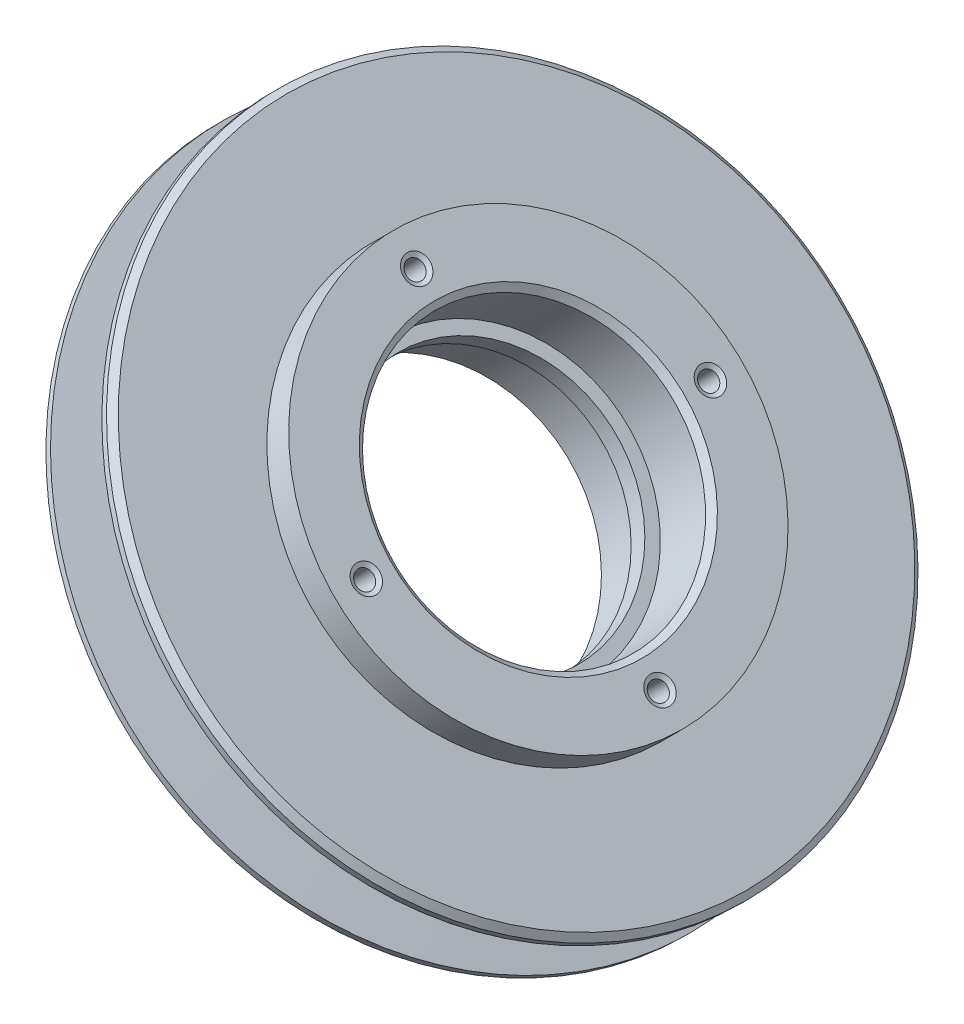
ISO-10303-21;
HEADER;
FILE_DESCRIPTION(('STEP AP214'),'2;1');
FILE_NAME('part.step','',(''),(''),'','','');
FILE_SCHEMA(('AUTOMOTIVE_DESIGN { 1 0 10303 214 1 1 1 1 }'));
ENDSEC;
DATA;
#1=APPLICATION_CONTEXT('core data for automotive mechanical design processes');
#2=APPLICATION_PROTOCOL_DEFINITION('international standard','automotive_design',2000,#1);
#3=PRODUCT_CONTEXT('',#1,'mechanical');
#4=PRODUCT('Part','Part','',(#3));
#5=PRODUCT_RELATED_PRODUCT_CATEGORY('part','',(#4));
#6=PRODUCT_DEFINITION_FORMATION('','',#4);
#7=PRODUCT_DEFINITION_CONTEXT('part definition',#1,'design');
#8=PRODUCT_DEFINITION('design','',#6,#7);
#9=PRODUCT_DEFINITION_SHAPE('','',#8);
#10=(LENGTH_UNIT() NAMED_UNIT(*) SI_UNIT(.MILLI.,.METRE.));
#11=(NAMED_UNIT(*) PLANE_ANGLE_UNIT() SI_UNIT($,.RADIAN.));
#12=(NAMED_UNIT(*) SI_UNIT($,.STERADIAN.) SOLID_ANGLE_UNIT());
#13=UNCERTAINTY_MEASURE_WITH_UNIT(LENGTH_MEASURE(1.E-05),#10,'distance_accuracy_value','');
#14=(GEOMETRIC_REPRESENTATION_CONTEXT(3) GLOBAL_UNCERTAINTY_ASSIGNED_CONTEXT((#13)) GLOBAL_UNIT_ASSIGNED_CONTEXT((#10,
#11,#12)) REPRESENTATION_CONTEXT('',''));
#15=CARTESIAN_POINT('',(0.,0.,0.));
#16=DIRECTION('',(0.,0.,1.));
#17=DIRECTION('',(1.,0.,0.));
#18=AXIS2_PLACEMENT_3D('',#15,#16,#17);
#19=CARTESIAN_POINT('',(-613.203104932864,800.665960875843,6.97564737441197));
#20=DIRECTION('',(0.707106785895525,0.70710677647757,0.));
#21=DIRECTION('',(-0.70710677647757,0.707106785895525,0.));
#22=AXIS2_PLACEMENT_3D('',#19,#20,#21);
#23=CYLINDRICAL_SURFACE('',#22,15.8750000000003);
#24=CARTESIAN_POINT('',(-613.764370944168,800.104694872014,6.97564737441197));
#25=DIRECTION('',(0.707106785895525,0.70710677647757,0.));
#26=DIRECTION('',(0.,0.,1.));
#27=AXIS2_PLACEMENT_3D('',#24,#25,#26);
#28=CIRCLE('',#27,15.8750000000003);
#29=CARTESIAN_POINT('',(-613.764370944168,800.104694872014,22.8506473744123));
#30=VERTEX_POINT('',#29);
#31=EDGE_CURVE('E10',#30,#30,#28,.T.);
#32=ORIENTED_EDGE('',*,*,#31,.T.);
#33=EDGE_LOOP('',(#32));
#34=FACE_BOUND('',#33,.T.);
#35=CARTESIAN_POINT('',(-615.470260408288,798.398805430616,6.97564737441196));
#36=DIRECTION('',(0.707106785895525,0.70710677647757,0.));
#37=DIRECTION('',(0.,0.,1.));
#38=AXIS2_PLACEMENT_3D('',#35,#36,#37);
#39=CIRCLE('',#38,15.8750000000003);
#40=CARTESIAN_POINT('',(-615.470260408288,798.398805430616,22.8506473744123));
#41=VERTEX_POINT('',#40);
#42=EDGE_CURVE('E31',#41,#41,#39,.T.);
#43=ORIENTED_EDGE('',*,*,#42,.F.);
#44=EDGE_LOOP('',(#43));
#45=FACE_BOUND('',#44,.T.);
#46=ADVANCED_FACE('F15',(#34,#45),#23,.F.);
#47=CARTESIAN_POINT('',(-613.764370944169,800.104694872014,23.6443973744122));
#48=DIRECTION('',(0.707106785895525,0.70710677647757,0.));
#49=DIRECTION('',(-0.70710677647757,0.707106785895525,0.));
#50=AXIS2_PLACEMENT_3D('',#47,#48,#49);
#51=PLANE('',#50);
#52=ORIENTED_EDGE('',*,*,#31,.F.);
#53=EDGE_LOOP('',(#52));
#54=FACE_BOUND('',#53,.T.);
#55=CARTESIAN_POINT('',(-613.764370944168,800.104694872014,6.97564737441197));
#56=DIRECTION('',(0.707106785895525,0.70710677647757,0.));
#57=DIRECTION('',(-0.70710677647757,0.707106785895525,0.));
#58=AXIS2_PLACEMENT_3D('',#55,#56,#57);
#59=CIRCLE('',#58,17.45234);
#60=CARTESIAN_POINT('',(-626.105038823559,812.44536291577,6.97564737441196));
#61=VERTEX_POINT('',#60);
#62=EDGE_CURVE('E23',#61,#61,#59,.T.);
#63=ORIENTED_EDGE('',*,*,#62,.T.);
#64=EDGE_LOOP('',(#63));
#65=FACE_BOUND('',#64,.T.);
#66=ADVANCED_FACE('F155',(#54,#65),#51,.T.);
#67=CARTESIAN_POINT('',(-609.554875859384,804.314189900732,6.97564737441197));
#68=DIRECTION('',(0.707106785895525,0.70710677647757,0.));
#69=DIRECTION('',(-0.70710677647757,0.707106785895525,0.));
#70=AXIS2_PLACEMENT_3D('',#67,#68,#69);
#71=CYLINDRICAL_SURFACE('',#70,17.45234);
#72=CARTESIAN_POINT('',(-608.129260190671,805.739805550458,6.97564737441197));
#73=DIRECTION('',(0.707106785895525,0.70710677647757,0.));
#74=DIRECTION('',(-0.70710677647757,0.707106785895525,0.));
#75=AXIS2_PLACEMENT_3D('',#72,#73,#74);
#76=CIRCLE('',#75,17.45234);
#77=CARTESIAN_POINT('',(-620.469928070062,818.080473594214,6.97564737441196));
#78=VERTEX_POINT('',#77);
#79=EDGE_CURVE('E28',#78,#78,#76,.T.);
#80=ORIENTED_EDGE('',*,*,#79,.T.);
#81=EDGE_LOOP('',(#80));
#82=FACE_BOUND('',#81,.T.);
#83=ORIENTED_EDGE('',*,*,#62,.F.);
#84=EDGE_LOOP('',(#83));
#85=FACE_BOUND('',#84,.T.);
#86=ADVANCED_FACE('F160',(#82,#85),#71,.F.);
#87=CARTESIAN_POINT('',(-613.203104932864,800.665960875843,6.97564737441197));
#88=DIRECTION('',(-0.707106785895525,-0.70710677647757,0.));
#89=DIRECTION('',(0.70710677647757,-0.707106785895525,0.));
#90=AXIS2_PLACEMENT_3D('',#87,#88,#89);
#91=CYLINDRICAL_SURFACE('',#90,25.4);
#92=CARTESIAN_POINT('',(-610.306795537838,803.562270232293,6.97564737441197));
#93=DIRECTION('',(-0.707106785895525,-0.70710677647757,0.));
#94=DIRECTION('',(0.70710677647757,-0.707106785895525,0.));
#95=AXIS2_PLACEMENT_3D('',#92,#93,#94);
#96=CIRCLE('',#95,25.4);
#97=CARTESIAN_POINT('',(-592.346283415308,785.601757870547,6.97564737441199));
#98=VERTEX_POINT('',#97);
#99=EDGE_CURVE('E42',#98,#98,#96,.T.);
#100=ORIENTED_EDGE('',*,*,#99,.F.);
#101=EDGE_LOOP('',(#100));
#102=FACE_BOUND('',#101,.T.);
#103=CARTESIAN_POINT('',(-607.590444819818,806.278620914134,6.97564737441197));
#104=DIRECTION('',(-0.707106785895525,-0.70710677647757,0.));
#105=DIRECTION('',(0.70710677647757,-0.707106785895525,0.));
#106=AXIS2_PLACEMENT_3D('',#103,#104,#105);
#107=CIRCLE('',#106,25.4);
#108=CARTESIAN_POINT('',(-589.629932697288,788.318108552388,6.97564737441199));
#109=VERTEX_POINT('',#108);
#110=EDGE_CURVE('E38',#109,#109,#107,.T.);
#111=ORIENTED_EDGE('',*,*,#110,.T.);
#112=EDGE_LOOP('',(#111));
#113=FACE_BOUND('',#112,.T.);
#114=ADVANCED_FACE('F167',(#102,#113),#91,.T.);
#115=CARTESIAN_POINT('',(-608.039457628862,805.829608111071,6.97564737441198));
#116=DIRECTION('',(-0.707106785895525,-0.70710677647757,0.));
#117=DIRECTION('',(0.70710677647757,-0.707106785895525,0.));
#118=AXIS2_PLACEMENT_3D('',#115,#116,#117);
#119=CYLINDRICAL_SURFACE('',#118,41.275);
#120=CARTESIAN_POINT('',(-611.415208501932,802.453857282962,6.97564737441198));
#121=DIRECTION('',(0.707106785895524,0.707106776477571,0.));
#122=DIRECTION('',(-0.703493124172285,0.703493133542108,-0.100969477078094));
#123=AXIS2_PLACEMENT_3D('',#120,#121,#122);
#124=CIRCLE('',#123,41.2749999999999);
#125=CARTESIAN_POINT('',(-640.451887202143,831.490536369912,2.80813220801366));
#126=VERTEX_POINT('',#125);
#127=EDGE_CURVE('E41',#126,#126,#124,.T.);
#128=ORIENTED_EDGE('',*,*,#127,.T.);
#129=EDGE_LOOP('',(#128));
#130=FACE_BOUND('',#129,.T.);
#131=CARTESIAN_POINT('',(-610.845610908691,803.023454868617,6.97564737441198));
#132=DIRECTION('',(-0.707106785895525,-0.70710677647757,0.));
#133=DIRECTION('',(0.70710677647757,-0.707106785895525,0.));
#134=AXIS2_PLACEMENT_3D('',#131,#132,#133);
#135=CIRCLE('',#134,41.275);
#136=CARTESIAN_POINT('',(-581.659778709579,773.837622280779,6.97564737441201));
#137=VERTEX_POINT('',#136);
#138=EDGE_CURVE('E49',#137,#137,#135,.T.);
#139=ORIENTED_EDGE('',*,*,#138,.T.);
#140=EDGE_LOOP('',(#139));
#141=FACE_BOUND('',#140,.T.);
#142=ADVANCED_FACE('F171',(#130,#141),#119,.T.);
#143=CARTESIAN_POINT('',(-621.644186532638,792.224879388496,26.8219630315023));
#144=DIRECTION('',(-0.707106785895525,-0.70710677647757,0.));
#145=DIRECTION('',(0.70710677647757,-0.707106785895525,0.));
#146=AXIS2_PLACEMENT_3D('',#143,#144,#145);
#147=PLANE('',#146);
#148=CARTESIAN_POINT('',(-621.644186532637,792.224879388496,-14.4556026255881));
#149=DIRECTION('',(-0.707106785895524,-0.707106776477571,0.));
#150=DIRECTION('',(0.707106776477571,-0.707106785895524,0.));
#151=AXIS2_PLACEMENT_3D('',#148,#149,#150);
#152=CIRCLE('',#151,1.65100000000001);
#153=CARTESIAN_POINT('',(-620.476753244673,791.057446084983,-14.4556026255881));
#154=VERTEX_POINT('',#153);
#155=EDGE_CURVE('E53',#154,#154,#152,.T.);
#156=ORIENTED_EDGE('',*,*,#155,.F.);
#157=EDGE_LOOP('',(#156));
#158=FACE_BOUND('',#157,.T.);
#159=CARTESIAN_POINT('',(-621.644186532638,792.224879388496,6.97564737441197));
#160=DIRECTION('',(-0.707106785895525,-0.70710677647757,0.));
#161=DIRECTION('',(0.70710677647757,-0.707106785895525,0.));
#162=AXIS2_PLACEMENT_3D('',#159,#160,#161);
#163=CIRCLE('',#162,18.21434);
#164=CARTESIAN_POINT('',(-608.764703289572,779.345395973888,6.97564737441198));
#165=VERTEX_POINT('',#164);
#166=EDGE_CURVE('E58',#165,#165,#163,.T.);
#167=ORIENTED_EDGE('',*,*,#166,.F.);
#168=EDGE_LOOP('',(#167));
#169=FACE_BOUND('',#168,.T.);
#170=CARTESIAN_POINT('',(-636.798368636023,807.379061693719,6.97564737441207));
#171=DIRECTION('',(-0.707106785895524,-0.707106776477571,0.));
#172=DIRECTION('',(0.707106776477571,-0.707106785895524,0.));
#173=AXIS2_PLACEMENT_3D('',#170,#171,#172);
#174=CIRCLE('',#173,1.65100000000001);
#175=CARTESIAN_POINT('',(-635.630935348059,806.211628390205,6.97564737441207));
#176=VERTEX_POINT('',#175);
#177=EDGE_CURVE('E46',#176,#176,#174,.T.);
#178=ORIENTED_EDGE('',*,*,#177,.F.);
#179=EDGE_LOOP('',(#178));
#180=FACE_BOUND('',#179,.T.);
#181=CARTESIAN_POINT('',(-606.490004429253,777.070697083272,6.97564737441206));
#182=DIRECTION('',(-0.707106785895524,-0.707106776477571,0.));
#183=DIRECTION('',(0.707106776477571,-0.707106785895524,0.));
#184=AXIS2_PLACEMENT_3D('',#181,#182,#183);
#185=CIRCLE('',#184,1.651);
#186=CARTESIAN_POINT('',(-605.322571141289,775.903263779759,6.97564737441206));
#187=VERTEX_POINT('',#186);
#188=EDGE_CURVE('E66',#187,#187,#185,.T.);
#189=ORIENTED_EDGE('',*,*,#188,.F.);
#190=EDGE_LOOP('',(#189));
#191=FACE_BOUND('',#190,.T.);
#192=CARTESIAN_POINT('',(-621.644186532637,792.224879388496,28.4068973744121));
#193=DIRECTION('',(-0.707106785895524,-0.707106776477571,0.));
#194=DIRECTION('',(0.707106776477571,-0.707106785895524,0.));
#195=AXIS2_PLACEMENT_3D('',#192,#193,#194);
#196=CIRCLE('',#195,1.65100000000001);
#197=CARTESIAN_POINT('',(-620.476753244673,791.057446084983,28.4068973744121));
#198=VERTEX_POINT('',#197);
#199=EDGE_CURVE('E69',#198,#198,#196,.T.);
#200=ORIENTED_EDGE('',*,*,#199,.F.);
#201=EDGE_LOOP('',(#200));
#202=FACE_BOUND('',#201,.T.);
#203=CARTESIAN_POINT('',(-621.644186532638,792.224879388496,6.97564737441198));
#204=DIRECTION('',(-0.707106785895525,-0.70710677647757,0.));
#205=DIRECTION('',(0.70710677647757,-0.707106785895525,0.));
#206=AXIS2_PLACEMENT_3D('',#203,#204,#205);
#207=CIRCLE('',#206,25.4);
#208=CARTESIAN_POINT('',(-603.683674410108,774.26436702675,6.975647374412));
#209=VERTEX_POINT('',#208);
#210=EDGE_CURVE('E52',#209,#209,#207,.T.);
#211=ORIENTED_EDGE('',*,*,#210,.T.);
#212=EDGE_LOOP('',(#211));
#213=FACE_BOUND('',#212,.T.);
#214=ADVANCED_FACE('F175',(#158,#169,#180,#191,#202,#213),#147,.T.);
#215=CARTESIAN_POINT('',(-616.851334006344,797.017731850954,6.97564737441197));
#216=DIRECTION('',(-0.707106785895525,-0.70710677647757,0.));
#217=DIRECTION('',(0.70710677647757,-0.707106785895525,0.));
#218=AXIS2_PLACEMENT_3D('',#215,#216,#217);
#219=CYLINDRICAL_SURFACE('',#218,17.45234);
#220=CARTESIAN_POINT('',(-621.105371161785,792.763694752172,6.97564737441197));
#221=DIRECTION('',(-0.707106785895525,-0.70710677647757,0.));
#222=DIRECTION('',(0.70710677647757,-0.707106785895525,0.));
#223=AXIS2_PLACEMENT_3D('',#220,#221,#222);
#224=CIRCLE('',#223,17.45234);
#225=CARTESIAN_POINT('',(-608.764703282394,780.423026708416,6.97564737441198));
#226=VERTEX_POINT('',#225);
#227=EDGE_CURVE('E33',#226,#226,#224,.T.);
#228=ORIENTED_EDGE('',*,*,#227,.T.);
#229=EDGE_LOOP('',(#228));
#230=FACE_BOUND('',#229,.T.);
#231=CARTESIAN_POINT('',(-615.470260408287,798.398805430616,6.97564737441197));
#232=DIRECTION('',(-0.707106785895525,-0.70710677647757,0.));
#233=DIRECTION('',(0.70710677647757,-0.707106785895525,0.));
#234=AXIS2_PLACEMENT_3D('',#231,#232,#233);
#235=CIRCLE('',#234,17.45234);
#236=CARTESIAN_POINT('',(-603.129592528896,786.05813738686,6.97564737441198));
#237=VERTEX_POINT('',#236);
#238=EDGE_CURVE('E34',#237,#237,#235,.T.);
#239=ORIENTED_EDGE('',*,*,#238,.F.);
#240=EDGE_LOOP('',(#239));
#241=FACE_BOUND('',#240,.T.);
#242=ADVANCED_FACE('F179',(#230,#241),#219,.F.);
#243=CARTESIAN_POINT('',(-615.470260408288,798.398805430616,23.6469630315023));
#244=DIRECTION('',(-0.707106785895525,-0.70710677647757,0.));
#245=DIRECTION('',(0.70710677647757,-0.707106785895525,0.));
#246=AXIS2_PLACEMENT_3D('',#243,#244,#245);
#247=PLANE('',#246);
#248=ORIENTED_EDGE('',*,*,#42,.T.);
#249=EDGE_LOOP('',(#248));
#250=FACE_BOUND('',#249,.T.);
#251=ORIENTED_EDGE('',*,*,#238,.T.);
#252=EDGE_LOOP('',(#251));
#253=FACE_BOUND('',#252,.T.);
#254=ADVANCED_FACE('F183',(#250,#253),#247,.T.);
#255=CARTESIAN_POINT('',(-618.92783864305,794.941227241906,34.2018847600014));
#256=DIRECTION('',(-0.707106785895525,-0.70710677647757,0.));
#257=DIRECTION('',(0.70710677647757,-0.707106785895525,0.));
#258=AXIS2_PLACEMENT_3D('',#255,#256,#257);
#259=PLANE('',#258);
#260=CARTESIAN_POINT('',(-618.927838643049,794.941227241906,6.97564737441198));
#261=DIRECTION('',(-0.707106785895525,-0.70710677647757,0.));
#262=DIRECTION('',(0.70710677647757,-0.707106785895525,0.));
#263=AXIS2_PLACEMENT_3D('',#260,#261,#262);
#264=CIRCLE('',#263,25.4);
#265=CARTESIAN_POINT('',(-600.967326520519,776.98071488016,6.975647374412));
#266=VERTEX_POINT('',#265);
#267=EDGE_CURVE('E45',#266,#266,#264,.T.);
#268=ORIENTED_EDGE('',*,*,#267,.F.);
#269=EDGE_LOOP('',(#268));
#270=FACE_BOUND('',#269,.T.);
#271=CARTESIAN_POINT('',(-618.927838643049,794.941227241906,6.97564737441198));
#272=DIRECTION('',(-0.707106785895525,-0.70710677647757,0.));
#273=DIRECTION('',(0.70710677647757,-0.707106785895525,0.));
#274=AXIS2_PLACEMENT_3D('',#271,#272,#273);
#275=CIRCLE('',#274,40.513);
#276=CARTESIAN_POINT('',(-590.280821807613,766.294210024921,6.97564737441201));
#277=VERTEX_POINT('',#276);
#278=EDGE_CURVE('E77',#277,#277,#275,.T.);
#279=ORIENTED_EDGE('',*,*,#278,.T.);
#280=EDGE_LOOP('',(#279));
#281=FACE_BOUND('',#280,.T.);
#282=ADVANCED_FACE('F187',(#270,#281),#259,.T.);
#283=CARTESIAN_POINT('',(-618.831535648556,795.037530235116,6.97564737441198));
#284=DIRECTION('',(-0.707106785895525,-0.70710677647757,0.));
#285=DIRECTION('',(0.70710677647757,-0.707106785895525,0.));
#286=AXIS2_PLACEMENT_3D('',#283,#284,#285);
#287=CYLINDRICAL_SURFACE('',#286,25.4);
#288=ORIENTED_EDGE('',*,*,#210,.F.);
#289=EDGE_LOOP('',(#288));
#290=FACE_BOUND('',#289,.T.);
#291=ORIENTED_EDGE('',*,*,#267,.T.);
#292=EDGE_LOOP('',(#291));
#293=FACE_BOUND('',#292,.T.);
#294=ADVANCED_FACE('F191',(#290,#293),#287,.T.);
#295=CARTESIAN_POINT('',(-607.590444819818,806.278620914134,40.6001468325524));
#296=DIRECTION('',(0.707106785895525,0.70710677647757,0.));
#297=DIRECTION('',(-0.70710677647757,0.707106785895525,0.));
#298=AXIS2_PLACEMENT_3D('',#295,#296,#297);
#299=PLANE('',#298);
#300=CARTESIAN_POINT('',(-607.590444819818,806.278620914133,-14.455602625588));
#301=DIRECTION('',(0.707106785895524,0.707106776477571,0.));
#302=DIRECTION('',(-0.707106776477571,0.707106785895524,0.));
#303=AXIS2_PLACEMENT_3D('',#300,#301,#302);
#304=CIRCLE('',#303,1.651);
#305=CARTESIAN_POINT('',(-608.757878107783,807.446054217647,-14.455602625588));
#306=VERTEX_POINT('',#305);
#307=EDGE_CURVE('E84',#306,#306,#304,.T.);
#308=ORIENTED_EDGE('',*,*,#307,.F.);
#309=EDGE_LOOP('',(#308));
#310=FACE_BOUND('',#309,.T.);
#311=CARTESIAN_POINT('',(-607.590444819818,806.278620914134,6.97564737441197));
#312=DIRECTION('',(0.707106785895525,0.70710677647757,0.));
#313=DIRECTION('',(-0.70710677647757,0.707106785895525,0.));
#314=AXIS2_PLACEMENT_3D('',#311,#312,#313);
#315=CIRCLE('',#314,18.21434);
#316=CARTESIAN_POINT('',(-620.469928062884,819.158104328742,6.97564737441196));
#317=VERTEX_POINT('',#316);
#318=EDGE_CURVE('E62',#317,#317,#315,.T.);
#319=ORIENTED_EDGE('',*,*,#318,.F.);
#320=EDGE_LOOP('',(#319));
#321=FACE_BOUND('',#320,.T.);
#322=CARTESIAN_POINT('',(-592.436262716433,791.12443860891,6.97564737441207));
#323=DIRECTION('',(0.707106785895524,0.707106776477571,0.));
#324=DIRECTION('',(-0.707106776477571,0.707106785895524,0.));
#325=AXIS2_PLACEMENT_3D('',#322,#323,#324);
#326=CIRCLE('',#325,1.651);
#327=CARTESIAN_POINT('',(-593.603696004397,792.291871912424,6.97564737441207));
#328=VERTEX_POINT('',#327);
#329=EDGE_CURVE('E91',#328,#328,#326,.T.);
#330=ORIENTED_EDGE('',*,*,#329,.F.);
#331=EDGE_LOOP('',(#330));
#332=FACE_BOUND('',#331,.T.);
#333=CARTESIAN_POINT('',(-622.744626923203,821.432803219357,6.9756473744121));
#334=DIRECTION('',(0.707106785895524,0.707106776477571,0.));
#335=DIRECTION('',(-0.707106776477571,0.707106785895524,0.));
#336=AXIS2_PLACEMENT_3D('',#333,#334,#335);
#337=CIRCLE('',#336,1.651);
#338=CARTESIAN_POINT('',(-623.912060211167,822.600236522871,6.9756473744121));
#339=VERTEX_POINT('',#338);
#340=EDGE_CURVE('E57',#339,#339,#337,.T.);
#341=ORIENTED_EDGE('',*,*,#340,.F.);
#342=EDGE_LOOP('',(#341));
#343=FACE_BOUND('',#342,.T.);
#344=CARTESIAN_POINT('',(-607.590444819818,806.278620914133,28.4068973744122));
#345=DIRECTION('',(0.707106785895524,0.707106776477571,0.));
#346=DIRECTION('',(-0.707106776477571,0.707106785895524,0.));
#347=AXIS2_PLACEMENT_3D('',#344,#345,#346);
#348=CIRCLE('',#347,1.651);
#349=CARTESIAN_POINT('',(-608.757878107783,807.446054217647,28.4068973744122));
#350=VERTEX_POINT('',#349);
#351=EDGE_CURVE('E96',#350,#350,#348,.T.);
#352=ORIENTED_EDGE('',*,*,#351,.F.);
#353=EDGE_LOOP('',(#352));
#354=FACE_BOUND('',#353,.T.);
#355=ORIENTED_EDGE('',*,*,#110,.F.);
#356=EDGE_LOOP('',(#355));
#357=FACE_BOUND('',#356,.T.);
#358=ADVANCED_FACE('F195',(#310,#321,#332,#343,#354,#357),#299,.T.);
#359=CARTESIAN_POINT('',(-610.306795537838,803.562270232293,48.5100691872056));
#360=DIRECTION('',(-0.707106785895525,-0.70710677647757,0.));
#361=DIRECTION('',(0.70710677647757,-0.707106785895525,0.));
#362=AXIS2_PLACEMENT_3D('',#359,#360,#361);
#363=PLANE('',#362);
#364=ORIENTED_EDGE('',*,*,#99,.T.);
#365=EDGE_LOOP('',(#364));
#366=FACE_BOUND('',#365,.T.);
#367=CARTESIAN_POINT('',(-610.306795537838,803.562270232293,6.97564737441198));
#368=DIRECTION('',(-0.707106785895525,-0.70710677647757,0.));
#369=DIRECTION('',(0.70710677647757,-0.707106785895525,0.));
#370=AXIS2_PLACEMENT_3D('',#367,#368,#369);
#371=CIRCLE('',#370,40.513);
#372=CARTESIAN_POINT('',(-581.659778702402,774.915253015308,6.97564737441201));
#373=VERTEX_POINT('',#372);
#374=EDGE_CURVE('E100',#373,#373,#371,.T.);
#375=ORIENTED_EDGE('',*,*,#374,.F.);
#376=EDGE_LOOP('',(#375));
#377=FACE_BOUND('',#376,.T.);
#378=ADVANCED_FACE('F199',(#366,#377),#363,.F.);
#379=CARTESIAN_POINT('',(-636.585793749762,807.591636577148,6.97564737441207));
#380=DIRECTION('',(-0.707106785895487,-0.707106776477608,0.));
#381=DIRECTION('',(0.,0.,1.));
#382=AXIS2_PLACEMENT_3D('',#379,#380,#381);
#383=CONICAL_SURFACE('',#382,1.1303,1.04719755119663);
#384=ORIENTED_EDGE('',*,*,#177,.T.);
#385=EDGE_LOOP('',(#384));
#386=FACE_BOUND('',#385,.T.);
#387=CARTESIAN_POINT('',(-636.585793749762,807.591636577148,6.97564737441207));
#388=DIRECTION('',(-0.707106785895524,-0.707106776477571,0.));
#389=DIRECTION('',(0.707106776477571,-0.707106785895524,0.));
#390=AXIS2_PLACEMENT_3D('',#387,#388,#389);
#391=CIRCLE('',#390,1.1303);
#392=CARTESIAN_POINT('',(-635.786550960309,806.79239377705,6.97564737441207));
#393=VERTEX_POINT('',#392);
#394=EDGE_CURVE('E105',#393,#393,#391,.T.);
#395=ORIENTED_EDGE('',*,*,#394,.F.);
#396=EDGE_LOOP('',(#395));
#397=FACE_BOUND('',#396,.T.);
#398=ADVANCED_FACE('F203',(#386,#397),#383,.F.);
#399=CARTESIAN_POINT('',(-618.389023272197,795.480042605582,6.97564737441198));
#400=DIRECTION('',(0.707106785895524,0.707106776477571,0.));
#401=DIRECTION('',(-0.707106776477571,0.707106785895524,0.));
#402=AXIS2_PLACEMENT_3D('',#399,#400,#401);
#403=CONICAL_SURFACE('',#402,41.275,0.785398163397455);
#404=CARTESIAN_POINT('',(-618.389023272197,795.480042605582,6.97564737441198));
#405=DIRECTION('',(-0.707106785895525,-0.70710677647757,0.));
#406=DIRECTION('',(0.70710677647757,-0.707106785895525,0.));
#407=AXIS2_PLACEMENT_3D('',#404,#405,#406);
#408=CIRCLE('',#407,41.275);
#409=CARTESIAN_POINT('',(-589.203191073085,766.294210017744,6.97564737441201));
#410=VERTEX_POINT('',#409);
#411=EDGE_CURVE('E65',#410,#410,#408,.T.);
#412=ORIENTED_EDGE('',*,*,#411,.T.);
#413=EDGE_LOOP('',(#412));
#414=FACE_BOUND('',#413,.T.);
#415=ORIENTED_EDGE('',*,*,#278,.F.);
#416=EDGE_LOOP('',(#415));
#417=FACE_BOUND('',#416,.T.);
#418=ADVANCED_FACE('F207',(#414,#417),#403,.T.);
#419=CARTESIAN_POINT('',(-608.039457628862,805.829608111071,6.97564737441198));
#420=DIRECTION('',(-0.707106785895525,-0.70710677647757,0.));
#421=DIRECTION('',(0.70710677647757,-0.707106785895525,0.));
#422=AXIS2_PLACEMENT_3D('',#419,#420,#421);
#423=CYLINDRICAL_SURFACE('',#422,41.275);
#424=ORIENTED_EDGE('',*,*,#411,.F.);
#425=EDGE_LOOP('',(#424));
#426=FACE_BOUND('',#425,.T.);
#427=CARTESIAN_POINT('',(-617.819425678955,796.049640191237,6.97564737441198));
#428=DIRECTION('',(-0.707106785895524,-0.707106776477571,0.));
#429=DIRECTION('',(0.703493124172285,-0.703493133542108,0.100969477078094));
#430=AXIS2_PLACEMENT_3D('',#427,#428,#429);
#431=CIRCLE('',#430,41.2750000000001);
#432=CARTESIAN_POINT('',(-588.782746978744,767.012961104286,11.1431625408103));
#433=VERTEX_POINT('',#432);
#434=EDGE_CURVE('E108',#433,#433,#431,.T.);
#435=ORIENTED_EDGE('',*,*,#434,.T.);
#436=EDGE_LOOP('',(#435));
#437=FACE_BOUND('',#436,.T.);
#438=ADVANCED_FACE('F211',(#426,#437),#423,.T.);
#439=CARTESIAN_POINT('',(-611.429327560447,802.439738224636,6.97564737441197));
#440=DIRECTION('',(0.707106785895518,0.707106776477577,0.));
#441=DIRECTION('',(-0.703493124172291,0.703493133542102,-0.100969477078094));
#442=AXIS2_PLACEMENT_3D('',#439,#440,#441);
#443=CONICAL_SURFACE('',#442,40.894,1.51843644923506);
#444=ORIENTED_EDGE('',*,*,#127,.F.);
#445=EDGE_LOOP('',(#444));
#446=FACE_BOUND('',#445,.T.);
#447=CARTESIAN_POINT('',(-611.947752089696,801.921313702291,6.97564737441197));
#448=DIRECTION('',(-0.707106785895524,-0.707106776477571,0.));
#449=DIRECTION('',(0.,0.,-1.));
#450=AXIS2_PLACEMENT_3D('',#447,#448,#449);
#451=CIRCLE('',#450,26.9044166694643);
#452=CARTESIAN_POINT('',(-611.947752089696,801.921313702291,-19.9287692950523));
#453=VERTEX_POINT('',#452);
#454=EDGE_CURVE('E104',#453,#453,#451,.T.);
#455=ORIENTED_EDGE('',*,*,#454,.F.);
#456=EDGE_LOOP('',(#455));
#457=FACE_BOUND('',#456,.T.);
#458=ADVANCED_FACE('F215',(#446,#457),#443,.T.);
#459=CARTESIAN_POINT('',(-636.798368636023,807.379061693719,6.97564737441207));
#460=DIRECTION('',(-0.707106785895524,-0.707106776477571,0.));
#461=DIRECTION('',(0.707106776477571,-0.707106785895524,0.));
#462=AXIS2_PLACEMENT_3D('',#459,#460,#461);
#463=CYLINDRICAL_SURFACE('',#462,1.1303);
#464=ORIENTED_EDGE('',*,*,#394,.T.);
#465=EDGE_LOOP('',(#464));
#466=FACE_BOUND('',#465,.T.);
#467=CARTESIAN_POINT('',(-622.957201809463,821.220228335928,6.9756473744121));
#468=DIRECTION('',(0.707106785895524,0.707106776477571,0.));
#469=DIRECTION('',(-0.707106776477571,0.707106785895524,0.));
#470=AXIS2_PLACEMENT_3D('',#467,#468,#469);
#471=CIRCLE('',#470,1.1303);
#472=CARTESIAN_POINT('',(-623.756444598916,822.019471136026,6.9756473744121));
#473=VERTEX_POINT('',#472);
#474=EDGE_CURVE('E56',#473,#473,#471,.T.);
#475=ORIENTED_EDGE('',*,*,#474,.T.);
#476=EDGE_LOOP('',(#475));
#477=FACE_BOUND('',#476,.T.);
#478=ADVANCED_FACE('F219',(#466,#477),#463,.F.);
#479=CARTESIAN_POINT('',(-616.165888459706,797.703177388463,6.97564737441198));
#480=DIRECTION('',(-0.707106785895524,-0.707106776477571,0.));
#481=DIRECTION('',(0.,0.,1.));
#482=AXIS2_PLACEMENT_3D('',#479,#480,#481);
#483=TOROIDAL_SURFACE('',#482,26.9875,1.5875);
#484=CARTESIAN_POINT('',(-617.286882091191,796.582183771909,6.97564737441198));
#485=DIRECTION('',(-0.707106785895524,-0.707106776477571,0.));
#486=DIRECTION('',(0.,0.,1.));
#487=AXIS2_PLACEMENT_3D('',#484,#485,#486);
#488=CIRCLE('',#487,26.9044166694643);
#489=CARTESIAN_POINT('',(-617.286882091191,796.582183771909,33.8800640438763));
#490=VERTEX_POINT('',#489);
#491=EDGE_CURVE('E116',#490,#490,#488,.T.);
#492=ORIENTED_EDGE('',*,*,#491,.F.);
#493=EDGE_LOOP('',(#492));
#494=FACE_BOUND('',#493,.T.);
#495=CARTESIAN_POINT('',(-616.165888459706,797.703177388463,6.97564737441198));
#496=DIRECTION('',(-0.707106785895524,-0.707106776477571,0.));
#497=DIRECTION('',(0.,0.,1.));
#498=AXIS2_PLACEMENT_3D('',#495,#496,#497);
#499=CIRCLE('',#498,25.4);
#500=CARTESIAN_POINT('',(-616.165888459706,797.703177388463,32.375647374412));
#501=VERTEX_POINT('',#500);
#502=EDGE_CURVE('E109',#501,#501,#499,.T.);
#503=ORIENTED_EDGE('',*,*,#502,.T.);
#504=EDGE_LOOP('',(#503));
#505=FACE_BOUND('',#504,.T.);
#506=ADVANCED_FACE('F223',(#494,#505),#483,.F.);
#507=CARTESIAN_POINT('',(-614.617317090444,799.2517487371,6.97564737441198));
#508=DIRECTION('',(-0.707106785895524,-0.707106776477571,0.));
#509=DIRECTION('',(0.703493124172285,-0.703493133542108,0.100969477078094));
#510=AXIS2_PLACEMENT_3D('',#507,#508,#509);
#511=CYLINDRICAL_SURFACE('',#510,25.4);
#512=ORIENTED_EDGE('',*,*,#502,.F.);
#513=EDGE_LOOP('',(#512));
#514=FACE_BOUND('',#513,.T.);
#515=CARTESIAN_POINT('',(-613.068745721182,800.800320085737,6.97564737441197));
#516=DIRECTION('',(-0.707106785895524,-0.707106776477571,0.));
#517=DIRECTION('',(0.,0.,-1.));
#518=AXIS2_PLACEMENT_3D('',#515,#516,#517);
#519=CIRCLE('',#518,25.4);
#520=CARTESIAN_POINT('',(-613.068745721182,800.800320085737,-18.424352625588));
#521=VERTEX_POINT('',#520);
#522=EDGE_CURVE('E103',#521,#521,#519,.T.);
#523=ORIENTED_EDGE('',*,*,#522,.T.);
#524=EDGE_LOOP('',(#523));
#525=FACE_BOUND('',#524,.T.);
#526=ADVANCED_FACE('F227',(#514,#525),#511,.T.);
#527=CARTESIAN_POINT('',(-610.845610908691,803.023454868617,6.97564737441198));
#528=DIRECTION('',(-0.707106785895525,-0.70710677647757,0.));
#529=DIRECTION('',(0.70710677647757,-0.707106785895525,0.));
#530=AXIS2_PLACEMENT_3D('',#527,#528,#529);
#531=CONICAL_SURFACE('',#530,41.275,0.785398163397448);
#532=ORIENTED_EDGE('',*,*,#138,.F.);
#533=EDGE_LOOP('',(#532));
#534=FACE_BOUND('',#533,.T.);
#535=ORIENTED_EDGE('',*,*,#374,.T.);
#536=EDGE_LOOP('',(#535));
#537=FACE_BOUND('',#536,.T.);
#538=ADVANCED_FACE('F231',(#534,#537),#531,.T.);
#539=CARTESIAN_POINT('',(-613.068745721182,800.800320085737,6.97564737441197));
#540=DIRECTION('',(0.707106785895524,0.707106776477571,0.));
#541=DIRECTION('',(0.,0.,-1.));
#542=AXIS2_PLACEMENT_3D('',#539,#540,#541);
#543=TOROIDAL_SURFACE('',#542,26.9875,1.5875);
#544=ORIENTED_EDGE('',*,*,#454,.T.);
#545=EDGE_LOOP('',(#544));
#546=FACE_BOUND('',#545,.T.);
#547=ORIENTED_EDGE('',*,*,#522,.F.);
#548=EDGE_LOOP('',(#547));
#549=FACE_BOUND('',#548,.T.);
#550=ADVANCED_FACE('F235',(#546,#549),#543,.F.);
#551=CARTESIAN_POINT('',(-617.80530662044,796.063759249564,6.97564737441198));
#552=DIRECTION('',(-0.707106785895544,-0.707106776477551,0.));
#553=DIRECTION('',(0.703493124172265,-0.703493133542128,0.100969477078094));
#554=AXIS2_PLACEMENT_3D('',#551,#552,#553);
#555=CONICAL_SURFACE('',#554,40.894,1.51843644923507);
#556=ORIENTED_EDGE('',*,*,#434,.F.);
#557=EDGE_LOOP('',(#556));
#558=FACE_BOUND('',#557,.T.);
#559=ORIENTED_EDGE('',*,*,#491,.T.);
#560=EDGE_LOOP('',(#559));
#561=FACE_BOUND('',#560,.T.);
#562=ADVANCED_FACE('F239',(#558,#561),#555,.T.);
#563=CARTESIAN_POINT('',(-607.590444819818,806.278620914133,28.4068973744122));
#564=DIRECTION('',(0.707106785895524,0.707106776477571,0.));
#565=DIRECTION('',(-0.707106776477571,0.707106785895524,0.));
#566=AXIS2_PLACEMENT_3D('',#563,#564,#565);
#567=CYLINDRICAL_SURFACE('',#566,1.1303);
#568=CARTESIAN_POINT('',(-607.803019706078,806.066046030704,28.4068973744122));
#569=DIRECTION('',(0.707106785895524,0.707106776477571,0.));
#570=DIRECTION('',(-0.707106776477571,0.707106785895524,0.));
#571=AXIS2_PLACEMENT_3D('',#568,#569,#570);
#572=CIRCLE('',#571,1.1303);
#573=CARTESIAN_POINT('',(-608.602262495531,806.865288830802,28.4068973744122));
#574=VERTEX_POINT('',#573);
#575=EDGE_CURVE('E99',#574,#574,#572,.T.);
#576=ORIENTED_EDGE('',*,*,#575,.T.);
#577=EDGE_LOOP('',(#576));
#578=FACE_BOUND('',#577,.T.);
#579=CARTESIAN_POINT('',(-621.431611646377,792.437454271924,28.4068973744121));
#580=DIRECTION('',(-0.707106785895524,-0.707106776477571,0.));
#581=DIRECTION('',(0.707106776477571,-0.707106785895524,0.));
#582=AXIS2_PLACEMENT_3D('',#579,#580,#581);
#583=CIRCLE('',#582,1.1303);
#584=CARTESIAN_POINT('',(-620.632368856924,791.638211471826,28.4068973744121));
#585=VERTEX_POINT('',#584);
#586=EDGE_CURVE('E72',#585,#585,#583,.T.);
#587=ORIENTED_EDGE('',*,*,#586,.T.);
#588=EDGE_LOOP('',(#587));
#589=FACE_BOUND('',#588,.T.);
#590=ADVANCED_FACE('F135',(#578,#589),#567,.F.);
#591=CARTESIAN_POINT('',(-606.490004429253,777.070697083272,6.97564737441206));
#592=DIRECTION('',(-0.707106785895524,-0.707106776477571,0.));
#593=DIRECTION('',(0.707106776477571,-0.707106785895524,0.));
#594=AXIS2_PLACEMENT_3D('',#591,#592,#593);
#595=CYLINDRICAL_SURFACE('',#594,1.1303);
#596=CARTESIAN_POINT('',(-606.277429542993,777.283271966701,6.97564737441206));
#597=DIRECTION('',(-0.707106785895524,-0.707106776477571,0.));
#598=DIRECTION('',(0.707106776477571,-0.707106785895524,0.));
#599=AXIS2_PLACEMENT_3D('',#596,#597,#598);
#600=CIRCLE('',#599,1.1303);
#601=CARTESIAN_POINT('',(-605.47818675354,776.484029166603,6.97564737441206));
#602=VERTEX_POINT('',#601);
#603=EDGE_CURVE('E19',#602,#602,#600,.T.);
#604=ORIENTED_EDGE('',*,*,#603,.T.);
#605=EDGE_LOOP('',(#604));
#606=FACE_BOUND('',#605,.T.);
#607=CARTESIAN_POINT('',(-592.648837602693,790.911863725481,6.97564737441207));
#608=DIRECTION('',(0.707106785895524,0.707106776477571,0.));
#609=DIRECTION('',(-0.707106776477571,0.707106785895524,0.));
#610=AXIS2_PLACEMENT_3D('',#607,#608,#609);
#611=CIRCLE('',#610,1.1303);
#612=CARTESIAN_POINT('',(-593.448080392146,791.711106525579,6.97564737441207));
#613=VERTEX_POINT('',#612);
#614=EDGE_CURVE('E88',#613,#613,#611,.T.);
#615=ORIENTED_EDGE('',*,*,#614,.T.);
#616=EDGE_LOOP('',(#615));
#617=FACE_BOUND('',#616,.T.);
#618=ADVANCED_FACE('F246',(#606,#617),#595,.F.);
#619=CARTESIAN_POINT('',(-607.803019706078,806.066046030704,28.4068973744122));
#620=DIRECTION('',(0.707106785895487,0.707106776477608,0.));
#621=DIRECTION('',(-0.707106776477608,0.707106785895487,0.));
#622=AXIS2_PLACEMENT_3D('',#619,#620,#621);
#623=CONICAL_SURFACE('',#622,1.1303,1.04719755119663);
#624=ORIENTED_EDGE('',*,*,#351,.T.);
#625=EDGE_LOOP('',(#624));
#626=FACE_BOUND('',#625,.T.);
#627=ORIENTED_EDGE('',*,*,#575,.F.);
#628=EDGE_LOOP('',(#627));
#629=FACE_BOUND('',#628,.T.);
#630=ADVANCED_FACE('F250',(#626,#629),#623,.F.);
#631=CARTESIAN_POINT('',(-621.431611646377,792.437454271925,-14.4556026255881));
#632=DIRECTION('',(-0.707106785895574,-0.707106776477521,0.));
#633=DIRECTION('',(0.707106776477521,-0.707106785895574,0.));
#634=AXIS2_PLACEMENT_3D('',#631,#632,#633);
#635=CONICAL_SURFACE('',#634,1.1303,1.04719755119658);
#636=ORIENTED_EDGE('',*,*,#155,.T.);
#637=EDGE_LOOP('',(#636));
#638=FACE_BOUND('',#637,.T.);
#639=CARTESIAN_POINT('',(-621.431611646377,792.437454271925,-14.4556026255881));
#640=DIRECTION('',(-0.707106785895524,-0.707106776477571,0.));
#641=DIRECTION('',(0.707106776477571,-0.707106785895524,0.));
#642=AXIS2_PLACEMENT_3D('',#639,#640,#641);
#643=CIRCLE('',#642,1.1303);
#644=CARTESIAN_POINT('',(-620.632368856924,791.638211471827,-14.4556026255881));
#645=VERTEX_POINT('',#644);
#646=EDGE_CURVE('E61',#645,#645,#643,.T.);
#647=ORIENTED_EDGE('',*,*,#646,.F.);
#648=EDGE_LOOP('',(#647));
#649=FACE_BOUND('',#648,.T.);
#650=ADVANCED_FACE('F254',(#638,#649),#635,.F.);
#651=CARTESIAN_POINT('',(-622.957201809463,821.220228335928,6.9756473744121));
#652=DIRECTION('',(0.707106785895487,0.707106776477608,0.));
#653=DIRECTION('',(0.,0.,-1.));
#654=AXIS2_PLACEMENT_3D('',#651,#652,#653);
#655=CONICAL_SURFACE('',#654,1.1303,1.04719755119663);
#656=ORIENTED_EDGE('',*,*,#340,.T.);
#657=EDGE_LOOP('',(#656));
#658=FACE_BOUND('',#657,.T.);
#659=ORIENTED_EDGE('',*,*,#474,.F.);
#660=EDGE_LOOP('',(#659));
#661=FACE_BOUND('',#660,.T.);
#662=ADVANCED_FACE('F258',(#658,#661),#655,.F.);
#663=CARTESIAN_POINT('',(-607.590444819818,806.278620914133,-14.455602625588));
#664=DIRECTION('',(0.707106785895524,0.707106776477571,0.));
#665=DIRECTION('',(-0.707106776477571,0.707106785895524,0.));
#666=AXIS2_PLACEMENT_3D('',#663,#664,#665);
#667=CYLINDRICAL_SURFACE('',#666,1.1303);
#668=ORIENTED_EDGE('',*,*,#646,.T.);
#669=EDGE_LOOP('',(#668));
#670=FACE_BOUND('',#669,.T.);
#671=CARTESIAN_POINT('',(-607.803019706078,806.066046030704,-14.455602625588));
#672=DIRECTION('',(0.707106785895524,0.707106776477571,0.));
#673=DIRECTION('',(-0.707106776477571,0.707106785895524,0.));
#674=AXIS2_PLACEMENT_3D('',#671,#672,#673);
#675=CIRCLE('',#674,1.1303);
#676=CARTESIAN_POINT('',(-608.602262495531,806.865288830802,-14.455602625588));
#677=VERTEX_POINT('',#676);
#678=EDGE_CURVE('E87',#677,#677,#675,.T.);
#679=ORIENTED_EDGE('',*,*,#678,.T.);
#680=EDGE_LOOP('',(#679));
#681=FACE_BOUND('',#680,.T.);
#682=ADVANCED_FACE('F262',(#670,#681),#667,.F.);
#683=CARTESIAN_POINT('',(-607.803019706078,806.066046030704,-14.455602625588));
#684=DIRECTION('',(0.707106785895574,0.707106776477521,0.));
#685=DIRECTION('',(-0.707106776477521,0.707106785895574,0.));
#686=AXIS2_PLACEMENT_3D('',#683,#684,#685);
#687=CONICAL_SURFACE('',#686,1.1303,1.04719755119658);
#688=ORIENTED_EDGE('',*,*,#307,.T.);
#689=EDGE_LOOP('',(#688));
#690=FACE_BOUND('',#689,.T.);
#691=ORIENTED_EDGE('',*,*,#678,.F.);
#692=EDGE_LOOP('',(#691));
#693=FACE_BOUND('',#692,.T.);
#694=ADVANCED_FACE('F151',(#690,#693),#687,.F.);
#695=CARTESIAN_POINT('',(-592.648837602693,790.911863725481,6.97564737441207));
#696=DIRECTION('',(0.707106785895487,0.707106776477608,0.));
#697=DIRECTION('',(0.,0.,-1.));
#698=AXIS2_PLACEMENT_3D('',#695,#696,#697);
#699=CONICAL_SURFACE('',#698,1.1303,1.04719755119653);
#700=ORIENTED_EDGE('',*,*,#329,.T.);
#701=EDGE_LOOP('',(#700));
#702=FACE_BOUND('',#701,.T.);
#703=ORIENTED_EDGE('',*,*,#614,.F.);
#704=EDGE_LOOP('',(#703));
#705=FACE_BOUND('',#704,.T.);
#706=ADVANCED_FACE('F140',(#702,#705),#699,.F.);
#707=CARTESIAN_POINT('',(-621.431611646377,792.437454271924,28.4068973744121));
#708=DIRECTION('',(-0.707106785895487,-0.707106776477608,0.));
#709=DIRECTION('',(0.707106776477608,-0.707106785895487,0.));
#710=AXIS2_PLACEMENT_3D('',#707,#708,#709);
#711=CONICAL_SURFACE('',#710,1.1303,1.04719755119663);
#712=ORIENTED_EDGE('',*,*,#199,.T.);
#713=EDGE_LOOP('',(#712));
#714=FACE_BOUND('',#713,.T.);
#715=ORIENTED_EDGE('',*,*,#586,.F.);
#716=EDGE_LOOP('',(#715));
#717=FACE_BOUND('',#716,.T.);
#718=ADVANCED_FACE('F137',(#714,#717),#711,.F.);
#719=CARTESIAN_POINT('',(-606.277429542993,777.283271966701,6.97564737441206));
#720=DIRECTION('',(-0.707106785895487,-0.707106776477608,0.));
#721=DIRECTION('',(0.,0.,1.));
#722=AXIS2_PLACEMENT_3D('',#719,#720,#721);
#723=CONICAL_SURFACE('',#722,1.1303,1.04719755119653);
#724=ORIENTED_EDGE('',*,*,#188,.T.);
#725=EDGE_LOOP('',(#724));
#726=FACE_BOUND('',#725,.T.);
#727=ORIENTED_EDGE('',*,*,#603,.F.);
#728=EDGE_LOOP('',(#727));
#729=FACE_BOUND('',#728,.T.);
#730=ADVANCED_FACE('F139',(#726,#729),#723,.F.);
#731=CARTESIAN_POINT('',(-621.644186532638,792.224879388496,6.97564737441197));
#732=DIRECTION('',(-0.707106785895525,-0.70710677647757,0.));
#733=DIRECTION('',(0.70710677647757,-0.707106785895525,0.));
#734=AXIS2_PLACEMENT_3D('',#731,#732,#733);
#735=CONICAL_SURFACE('',#734,18.21434,0.785398163397447);
#736=ORIENTED_EDGE('',*,*,#166,.T.);
#737=EDGE_LOOP('',(#736));
#738=FACE_BOUND('',#737,.T.);
#739=ORIENTED_EDGE('',*,*,#227,.F.);
#740=EDGE_LOOP('',(#739));
#741=FACE_BOUND('',#740,.T.);
#742=ADVANCED_FACE('F148',(#738,#741),#735,.F.);
#743=CARTESIAN_POINT('',(-607.590444819818,806.278620914134,6.97564737441197));
#744=DIRECTION('',(0.707106785895525,0.70710677647757,0.));
#745=DIRECTION('',(-0.70710677647757,0.707106785895525,0.));
#746=AXIS2_PLACEMENT_3D('',#743,#744,#745);
#747=CONICAL_SURFACE('',#746,18.21434,0.785398163397447);
#748=ORIENTED_EDGE('',*,*,#318,.T.);
#749=EDGE_LOOP('',(#748));
#750=FACE_BOUND('',#749,.T.);
#751=ORIENTED_EDGE('',*,*,#79,.F.);
#752=EDGE_LOOP('',(#751));
#753=FACE_BOUND('',#752,.T.);
#754=ADVANCED_FACE('F17',(#750,#753),#747,.F.);
#755=CLOSED_SHELL('',(#46,#66,#86,#114,#142,#214,#242,#254,#282,#294,#358,#378,#398,#418,#438,
#458,#478,#506,#526,#538,#550,#562,#590,#618,#630,#650,#662,#682,#694,#706,#718,#730,#742,#754));
#756=MANIFOLD_SOLID_BREP('B1',#755);
#757=ADVANCED_BREP_SHAPE_REPRESENTATION('',(#18,#756),#14);
#758=SHAPE_DEFINITION_REPRESENTATION(#9,#757);
ENDSEC;
END-ISO-10303-21;
